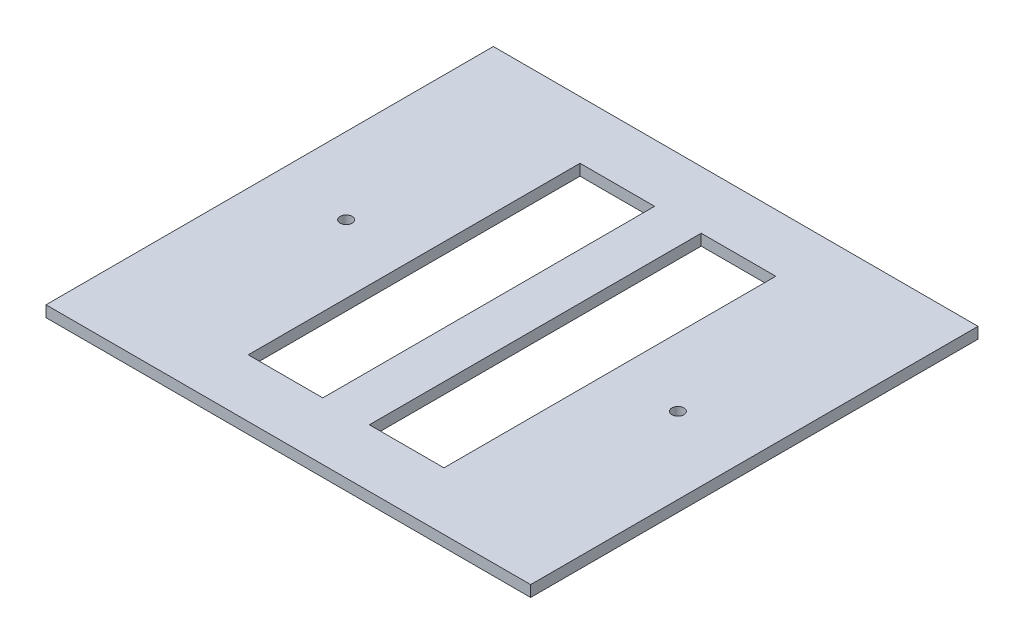
ISO-10303-21;
HEADER;
FILE_DESCRIPTION(('STEP AP214'),'2;1');
FILE_NAME('part.step','',(''),(''),'','','');
FILE_SCHEMA(('AUTOMOTIVE_DESIGN { 1 0 10303 214 1 1 1 1 }'));
ENDSEC;
DATA;
#1=APPLICATION_CONTEXT('core data for automotive mechanical design processes');
#2=APPLICATION_PROTOCOL_DEFINITION('international standard','automotive_design',2000,#1);
#3=PRODUCT_CONTEXT('',#1,'mechanical');
#4=PRODUCT('Part','Part','',(#3));
#5=PRODUCT_RELATED_PRODUCT_CATEGORY('part','',(#4));
#6=PRODUCT_DEFINITION_FORMATION('','',#4);
#7=PRODUCT_DEFINITION_CONTEXT('part definition',#1,'design');
#8=PRODUCT_DEFINITION('design','',#6,#7);
#9=PRODUCT_DEFINITION_SHAPE('','',#8);
#10=(LENGTH_UNIT() NAMED_UNIT(*) SI_UNIT(.MILLI.,.METRE.));
#11=(NAMED_UNIT(*) PLANE_ANGLE_UNIT() SI_UNIT($,.RADIAN.));
#12=(NAMED_UNIT(*) SI_UNIT($,.STERADIAN.) SOLID_ANGLE_UNIT());
#13=UNCERTAINTY_MEASURE_WITH_UNIT(LENGTH_MEASURE(1.E-05),#10,'distance_accuracy_value','');
#14=(GEOMETRIC_REPRESENTATION_CONTEXT(3) GLOBAL_UNCERTAINTY_ASSIGNED_CONTEXT((#13)) GLOBAL_UNIT_ASSIGNED_CONTEXT((#10,
#11,#12)) REPRESENTATION_CONTEXT('',''));
#15=CARTESIAN_POINT('',(0.,0.,0.));
#16=DIRECTION('',(0.,0.,1.));
#17=DIRECTION('',(1.,0.,0.));
#18=AXIS2_PLACEMENT_3D('',#15,#16,#17);
#19=CARTESIAN_POINT('',(0.,3.,0.));
#20=DIRECTION('',(0.,-1.,0.));
#21=DIRECTION('',(0.,0.,-1.));
#22=AXIS2_PLACEMENT_3D('',#19,#20,#21);
#23=PLANE('',#22);
#24=CARTESIAN_POINT('',(-44.5,3.,0.));
#25=DIRECTION('',(0.,-1.,0.));
#26=DIRECTION('',(0.,0.,-1.));
#27=AXIS2_PLACEMENT_3D('',#24,#25,#26);
#28=CIRCLE('',#27,1.6);
#29=CARTESIAN_POINT('',(-44.5,3.,-1.6));
#30=VERTEX_POINT('',#29);
#31=EDGE_CURVE('E313',#30,#30,#28,.F.);
#32=ORIENTED_EDGE('',*,*,#31,.F.);
#33=EDGE_LOOP('',(#32));
#34=FACE_BOUND('',#33,.T.);
#35=CARTESIAN_POINT('',(44.5,3.,0.));
#36=DIRECTION('',(0.,-1.,0.));
#37=DIRECTION('',(0.,0.,-1.));
#38=AXIS2_PLACEMENT_3D('',#35,#36,#37);
#39=CIRCLE('',#38,1.6);
#40=CARTESIAN_POINT('',(44.5,3.,-1.6));
#41=VERTEX_POINT('',#40);
#42=EDGE_CURVE('E138',#41,#41,#39,.T.);
#43=ORIENTED_EDGE('',*,*,#42,.T.);
#44=EDGE_LOOP('',(#43));
#45=FACE_BOUND('',#44,.T.);
#46=DIRECTION('',(0.,0.,-1.));
#47=VECTOR('',#46,1.);
#48=CARTESIAN_POINT('',(65.,3.,60.));
#49=LINE('',#48,#47);
#50=CARTESIAN_POINT('',(65.,3.,60.));
#51=VERTEX_POINT('',#50);
#52=CARTESIAN_POINT('',(65.,3.,-60.));
#53=VERTEX_POINT('',#52);
#54=EDGE_CURVE('E196',#51,#53,#49,.T.);
#55=ORIENTED_EDGE('',*,*,#54,.T.);
#56=DIRECTION('',(-1.,0.,0.));
#57=VECTOR('',#56,1.);
#58=CARTESIAN_POINT('',(-65.,3.,-60.));
#59=LINE('',#58,#57);
#60=CARTESIAN_POINT('',(-65.,3.,-60.));
#61=VERTEX_POINT('',#60);
#62=EDGE_CURVE('E199',#53,#61,#59,.T.);
#63=ORIENTED_EDGE('',*,*,#62,.T.);
#64=DIRECTION('',(0.,0.,1.));
#65=VECTOR('',#64,1.);
#66=CARTESIAN_POINT('',(-65.,3.,60.));
#67=LINE('',#66,#65);
#68=CARTESIAN_POINT('',(-65.,3.,60.));
#69=VERTEX_POINT('',#68);
#70=EDGE_CURVE('E202',#61,#69,#67,.T.);
#71=ORIENTED_EDGE('',*,*,#70,.T.);
#72=DIRECTION('',(1.,0.,0.));
#73=VECTOR('',#72,1.);
#74=CARTESIAN_POINT('',(-65.,3.,60.));
#75=LINE('',#74,#73);
#76=EDGE_CURVE('E204',#69,#51,#75,.T.);
#77=ORIENTED_EDGE('',*,*,#76,.T.);
#78=EDGE_LOOP('',(#55,#63,#71,#77));
#79=FACE_BOUND('',#78,.T.);
#80=DIRECTION('',(1.,0.,0.));
#81=VECTOR('',#80,1.);
#82=CARTESIAN_POINT('',(0.,3.,-44.5));
#83=LINE('',#82,#81);
#84=CARTESIAN_POINT('',(-26.25,3.,-44.5));
#85=VERTEX_POINT('',#84);
#86=CARTESIAN_POINT('',(-6.25,3.,-44.5));
#87=VERTEX_POINT('',#86);
#88=EDGE_CURVE('E176',#85,#87,#83,.T.);
#89=ORIENTED_EDGE('',*,*,#88,.T.);
#90=DIRECTION('',(0.,0.,1.));
#91=VECTOR('',#90,1.);
#92=CARTESIAN_POINT('',(-6.25,3.,0.));
#93=LINE('',#92,#91);
#94=CARTESIAN_POINT('',(-6.25,3.,44.5));
#95=VERTEX_POINT('',#94);
#96=EDGE_CURVE('E192',#87,#95,#93,.T.);
#97=ORIENTED_EDGE('',*,*,#96,.T.);
#98=DIRECTION('',(-1.,0.,0.));
#99=VECTOR('',#98,1.);
#100=CARTESIAN_POINT('',(0.,3.,44.5));
#101=LINE('',#100,#99);
#102=CARTESIAN_POINT('',(-26.25,3.,44.5));
#103=VERTEX_POINT('',#102);
#104=EDGE_CURVE('E189',#95,#103,#101,.T.);
#105=ORIENTED_EDGE('',*,*,#104,.T.);
#106=DIRECTION('',(0.,0.,-1.));
#107=VECTOR('',#106,1.);
#108=CARTESIAN_POINT('',(-26.25,3.,0.));
#109=LINE('',#108,#107);
#110=EDGE_CURVE('E186',#103,#85,#109,.T.);
#111=ORIENTED_EDGE('',*,*,#110,.T.);
#112=EDGE_LOOP('',(#89,#97,#105,#111));
#113=FACE_BOUND('',#112,.T.);
#114=DIRECTION('',(0.,0.,1.));
#115=VECTOR('',#114,1.);
#116=CARTESIAN_POINT('',(6.25,3.,0.));
#117=LINE('',#116,#115);
#118=CARTESIAN_POINT('',(6.25,3.,-44.5));
#119=VERTEX_POINT('',#118);
#120=CARTESIAN_POINT('',(6.25,3.,44.5));
#121=VERTEX_POINT('',#120);
#122=EDGE_CURVE('E132',#119,#121,#117,.T.);
#123=ORIENTED_EDGE('',*,*,#122,.F.);
#124=DIRECTION('',(-1.,0.,0.));
#125=VECTOR('',#124,1.);
#126=CARTESIAN_POINT('',(0.,3.,-44.5));
#127=LINE('',#126,#125);
#128=CARTESIAN_POINT('',(26.25,3.,-44.5));
#129=VERTEX_POINT('',#128);
#130=EDGE_CURVE('E157',#129,#119,#127,.T.);
#131=ORIENTED_EDGE('',*,*,#130,.F.);
#132=DIRECTION('',(0.,0.,-1.));
#133=VECTOR('',#132,1.);
#134=CARTESIAN_POINT('',(26.25,3.,0.));
#135=LINE('',#134,#133);
#136=CARTESIAN_POINT('',(26.25,3.,44.5));
#137=VERTEX_POINT('',#136);
#138=EDGE_CURVE('E155',#137,#129,#135,.T.);
#139=ORIENTED_EDGE('',*,*,#138,.F.);
#140=DIRECTION('',(1.,0.,0.));
#141=VECTOR('',#140,1.);
#142=CARTESIAN_POINT('',(0.,3.,44.5));
#143=LINE('',#142,#141);
#144=EDGE_CURVE('E149',#121,#137,#143,.T.);
#145=ORIENTED_EDGE('',*,*,#144,.F.);
#146=EDGE_LOOP('',(#123,#131,#139,#145));
#147=FACE_BOUND('',#146,.T.);
#148=ADVANCED_FACE('F33',(#34,#45,#79,#113,#147),#23,.F.);
#149=CARTESIAN_POINT('',(0.,0.,0.));
#150=DIRECTION('',(0.,-1.,0.));
#151=DIRECTION('',(0.,0.,-1.));
#152=AXIS2_PLACEMENT_3D('',#149,#150,#151);
#153=PLANE('',#152);
#154=CARTESIAN_POINT('',(-44.5,0.,0.));
#155=DIRECTION('',(0.,-1.,0.));
#156=DIRECTION('',(0.,0.,1.));
#157=AXIS2_PLACEMENT_3D('',#154,#155,#156);
#158=CIRCLE('',#157,1.6);
#159=CARTESIAN_POINT('',(-44.5,0.,1.6));
#160=VERTEX_POINT('',#159);
#161=EDGE_CURVE('E311',#160,#160,#158,.T.);
#162=ORIENTED_EDGE('',*,*,#161,.F.);
#163=EDGE_LOOP('',(#162));
#164=FACE_BOUND('',#163,.T.);
#165=CARTESIAN_POINT('',(44.5,0.,0.));
#166=DIRECTION('',(0.,1.,0.));
#167=DIRECTION('',(0.,0.,1.));
#168=AXIS2_PLACEMENT_3D('',#165,#166,#167);
#169=CIRCLE('',#168,1.6);
#170=CARTESIAN_POINT('',(44.5,0.,1.6));
#171=VERTEX_POINT('',#170);
#172=EDGE_CURVE('E141',#171,#171,#169,.T.);
#173=ORIENTED_EDGE('',*,*,#172,.T.);
#174=EDGE_LOOP('',(#173));
#175=FACE_BOUND('',#174,.T.);
#176=DIRECTION('',(0.,0.,-1.));
#177=VECTOR('',#176,1.);
#178=CARTESIAN_POINT('',(-6.25,0.,44.5));
#179=LINE('',#178,#177);
#180=CARTESIAN_POINT('',(-6.25,0.,44.5));
#181=VERTEX_POINT('',#180);
#182=CARTESIAN_POINT('',(-6.25,0.,-44.5));
#183=VERTEX_POINT('',#182);
#184=EDGE_CURVE('E160',#181,#183,#179,.T.);
#185=ORIENTED_EDGE('',*,*,#184,.T.);
#186=DIRECTION('',(-1.,0.,0.));
#187=VECTOR('',#186,1.);
#188=CARTESIAN_POINT('',(-26.25,0.,-44.5));
#189=LINE('',#188,#187);
#190=CARTESIAN_POINT('',(-26.25,0.,-44.5));
#191=VERTEX_POINT('',#190);
#192=EDGE_CURVE('E163',#183,#191,#189,.T.);
#193=ORIENTED_EDGE('',*,*,#192,.T.);
#194=DIRECTION('',(0.,0.,1.));
#195=VECTOR('',#194,1.);
#196=CARTESIAN_POINT('',(-26.25,0.,44.5));
#197=LINE('',#196,#195);
#198=CARTESIAN_POINT('',(-26.25,0.,44.5));
#199=VERTEX_POINT('',#198);
#200=EDGE_CURVE('E166',#191,#199,#197,.T.);
#201=ORIENTED_EDGE('',*,*,#200,.T.);
#202=DIRECTION('',(1.,0.,0.));
#203=VECTOR('',#202,1.);
#204=CARTESIAN_POINT('',(-26.25,0.,44.5));
#205=LINE('',#204,#203);
#206=EDGE_CURVE('E169',#199,#181,#205,.T.);
#207=ORIENTED_EDGE('',*,*,#206,.T.);
#208=EDGE_LOOP('',(#185,#193,#201,#207));
#209=FACE_BOUND('',#208,.T.);
#210=DIRECTION('',(0.,0.,-1.));
#211=VECTOR('',#210,1.);
#212=CARTESIAN_POINT('',(65.,0.,60.));
#213=LINE('',#212,#211);
#214=CARTESIAN_POINT('',(65.,0.,60.));
#215=VERTEX_POINT('',#214);
#216=CARTESIAN_POINT('',(65.,0.,-60.));
#217=VERTEX_POINT('',#216);
#218=EDGE_CURVE('E195',#215,#217,#213,.T.);
#219=ORIENTED_EDGE('',*,*,#218,.F.);
#220=DIRECTION('',(1.,0.,0.));
#221=VECTOR('',#220,1.);
#222=CARTESIAN_POINT('',(-65.,0.,60.));
#223=LINE('',#222,#221);
#224=CARTESIAN_POINT('',(-65.,0.,60.));
#225=VERTEX_POINT('',#224);
#226=EDGE_CURVE('E200',#225,#215,#223,.T.);
#227=ORIENTED_EDGE('',*,*,#226,.F.);
#228=DIRECTION('',(0.,0.,1.));
#229=VECTOR('',#228,1.);
#230=CARTESIAN_POINT('',(-65.,0.,60.));
#231=LINE('',#230,#229);
#232=CARTESIAN_POINT('',(-65.,0.,-60.));
#233=VERTEX_POINT('',#232);
#234=EDGE_CURVE('E211',#233,#225,#231,.T.);
#235=ORIENTED_EDGE('',*,*,#234,.F.);
#236=DIRECTION('',(-1.,0.,0.));
#237=VECTOR('',#236,1.);
#238=CARTESIAN_POINT('',(-65.,0.,-60.));
#239=LINE('',#238,#237);
#240=EDGE_CURVE('E209',#217,#233,#239,.T.);
#241=ORIENTED_EDGE('',*,*,#240,.F.);
#242=EDGE_LOOP('',(#219,#227,#235,#241));
#243=FACE_BOUND('',#242,.T.);
#244=DIRECTION('',(1.,0.,0.));
#245=VECTOR('',#244,1.);
#246=CARTESIAN_POINT('',(26.25,0.,-44.5));
#247=LINE('',#246,#245);
#248=CARTESIAN_POINT('',(6.25,0.,-44.5));
#249=VERTEX_POINT('',#248);
#250=CARTESIAN_POINT('',(26.25,0.,-44.5));
#251=VERTEX_POINT('',#250);
#252=EDGE_CURVE('E134',#249,#251,#247,.T.);
#253=ORIENTED_EDGE('',*,*,#252,.F.);
#254=DIRECTION('',(0.,0.,-1.));
#255=VECTOR('',#254,1.);
#256=CARTESIAN_POINT('',(6.25,0.,44.5));
#257=LINE('',#256,#255);
#258=CARTESIAN_POINT('',(6.25,0.,44.5));
#259=VERTEX_POINT('',#258);
#260=EDGE_CURVE('E125',#259,#249,#257,.T.);
#261=ORIENTED_EDGE('',*,*,#260,.F.);
#262=DIRECTION('',(-1.,0.,0.));
#263=VECTOR('',#262,1.);
#264=CARTESIAN_POINT('',(26.25,0.,44.5));
#265=LINE('',#264,#263);
#266=CARTESIAN_POINT('',(26.25,0.,44.5));
#267=VERTEX_POINT('',#266);
#268=EDGE_CURVE('E119',#267,#259,#265,.T.);
#269=ORIENTED_EDGE('',*,*,#268,.F.);
#270=DIRECTION('',(0.,0.,1.));
#271=VECTOR('',#270,1.);
#272=CARTESIAN_POINT('',(26.25,0.,44.5));
#273=LINE('',#272,#271);
#274=EDGE_CURVE('E124',#251,#267,#273,.T.);
#275=ORIENTED_EDGE('',*,*,#274,.F.);
#276=EDGE_LOOP('',(#253,#261,#269,#275));
#277=FACE_BOUND('',#276,.T.);
#278=ADVANCED_FACE('F137',(#164,#175,#209,#243,#277),#153,.T.);
#279=CARTESIAN_POINT('',(65.,3.,60.));
#280=DIRECTION('',(-1.,0.,0.));
#281=DIRECTION('',(0.,0.,1.));
#282=AXIS2_PLACEMENT_3D('',#279,#280,#281);
#283=PLANE('',#282);
#284=ORIENTED_EDGE('',*,*,#218,.T.);
#285=DIRECTION('',(0.,-1.,0.));
#286=VECTOR('',#285,1.);
#287=CARTESIAN_POINT('',(65.,3.,-60.));
#288=LINE('',#287,#286);
#289=EDGE_CURVE('E11',#53,#217,#288,.T.);
#290=ORIENTED_EDGE('',*,*,#289,.F.);
#291=ORIENTED_EDGE('',*,*,#54,.F.);
#292=DIRECTION('',(0.,-1.,0.));
#293=VECTOR('',#292,1.);
#294=CARTESIAN_POINT('',(65.,3.,60.));
#295=LINE('',#294,#293);
#296=EDGE_CURVE('E206',#51,#215,#295,.T.);
#297=ORIENTED_EDGE('',*,*,#296,.T.);
#298=EDGE_LOOP('',(#284,#290,#291,#297));
#299=FACE_BOUND('',#298,.T.);
#300=ADVANCED_FACE('F35',(#299),#283,.F.);
#301=CARTESIAN_POINT('',(-65.,3.,-60.));
#302=DIRECTION('',(0.,0.,1.));
#303=DIRECTION('',(1.,0.,0.));
#304=AXIS2_PLACEMENT_3D('',#301,#302,#303);
#305=PLANE('',#304);
#306=ORIENTED_EDGE('',*,*,#240,.T.);
#307=DIRECTION('',(0.,-1.,0.));
#308=VECTOR('',#307,1.);
#309=CARTESIAN_POINT('',(-65.,3.,-60.));
#310=LINE('',#309,#308);
#311=EDGE_CURVE('E41',#61,#233,#310,.T.);
#312=ORIENTED_EDGE('',*,*,#311,.F.);
#313=ORIENTED_EDGE('',*,*,#62,.F.);
#314=ORIENTED_EDGE('',*,*,#289,.T.);
#315=EDGE_LOOP('',(#306,#312,#313,#314));
#316=FACE_BOUND('',#315,.T.);
#317=ADVANCED_FACE('F238',(#316),#305,.F.);
#318=CARTESIAN_POINT('',(-65.,3.,60.));
#319=DIRECTION('',(1.,0.,0.));
#320=DIRECTION('',(0.,0.,-1.));
#321=AXIS2_PLACEMENT_3D('',#318,#319,#320);
#322=PLANE('',#321);
#323=ORIENTED_EDGE('',*,*,#234,.T.);
#324=DIRECTION('',(0.,-1.,0.));
#325=VECTOR('',#324,1.);
#326=CARTESIAN_POINT('',(-65.,3.,60.));
#327=LINE('',#326,#325);
#328=EDGE_CURVE('E216',#69,#225,#327,.T.);
#329=ORIENTED_EDGE('',*,*,#328,.F.);
#330=ORIENTED_EDGE('',*,*,#70,.F.);
#331=ORIENTED_EDGE('',*,*,#311,.T.);
#332=EDGE_LOOP('',(#323,#329,#330,#331));
#333=FACE_BOUND('',#332,.T.);
#334=ADVANCED_FACE('F223',(#333),#322,.F.);
#335=CARTESIAN_POINT('',(-65.,3.,60.));
#336=DIRECTION('',(0.,0.,-1.));
#337=DIRECTION('',(-1.,0.,0.));
#338=AXIS2_PLACEMENT_3D('',#335,#336,#337);
#339=PLANE('',#338);
#340=ORIENTED_EDGE('',*,*,#226,.T.);
#341=ORIENTED_EDGE('',*,*,#296,.F.);
#342=ORIENTED_EDGE('',*,*,#76,.F.);
#343=ORIENTED_EDGE('',*,*,#328,.T.);
#344=EDGE_LOOP('',(#340,#341,#342,#343));
#345=FACE_BOUND('',#344,.T.);
#346=ADVANCED_FACE('F231',(#345),#339,.F.);
#347=CARTESIAN_POINT('',(-6.25,0.,44.5));
#348=DIRECTION('',(1.,0.,0.));
#349=DIRECTION('',(0.,0.,-1.));
#350=AXIS2_PLACEMENT_3D('',#347,#348,#349);
#351=PLANE('',#350);
#352=DIRECTION('',(0.,1.,0.));
#353=VECTOR('',#352,1.);
#354=CARTESIAN_POINT('',(-6.25,0.,-44.5));
#355=LINE('',#354,#353);
#356=EDGE_CURVE('E172',#183,#87,#355,.T.);
#357=ORIENTED_EDGE('',*,*,#356,.F.);
#358=ORIENTED_EDGE('',*,*,#184,.F.);
#359=DIRECTION('',(0.,1.,0.));
#360=VECTOR('',#359,1.);
#361=CARTESIAN_POINT('',(-6.25,0.,44.5));
#362=LINE('',#361,#360);
#363=EDGE_CURVE('E173',#181,#95,#362,.T.);
#364=ORIENTED_EDGE('',*,*,#363,.T.);
#365=ORIENTED_EDGE('',*,*,#96,.F.);
#366=EDGE_LOOP('',(#357,#358,#364,#365));
#367=FACE_BOUND('',#366,.T.);
#368=ADVANCED_FACE('F256',(#367),#351,.F.);
#369=CARTESIAN_POINT('',(-26.25,0.,44.5));
#370=DIRECTION('',(0.,0.,1.));
#371=DIRECTION('',(1.,0.,0.));
#372=AXIS2_PLACEMENT_3D('',#369,#370,#371);
#373=PLANE('',#372);
#374=ORIENTED_EDGE('',*,*,#363,.F.);
#375=ORIENTED_EDGE('',*,*,#206,.F.);
#376=DIRECTION('',(0.,1.,0.));
#377=VECTOR('',#376,1.);
#378=CARTESIAN_POINT('',(-26.25,0.,44.5));
#379=LINE('',#378,#377);
#380=EDGE_CURVE('E177',#199,#103,#379,.T.);
#381=ORIENTED_EDGE('',*,*,#380,.T.);
#382=ORIENTED_EDGE('',*,*,#104,.F.);
#383=EDGE_LOOP('',(#374,#375,#381,#382));
#384=FACE_BOUND('',#383,.T.);
#385=ADVANCED_FACE('F263',(#384),#373,.F.);
#386=CARTESIAN_POINT('',(-26.25,0.,44.5));
#387=DIRECTION('',(-1.,0.,0.));
#388=DIRECTION('',(0.,0.,1.));
#389=AXIS2_PLACEMENT_3D('',#386,#387,#388);
#390=PLANE('',#389);
#391=ORIENTED_EDGE('',*,*,#380,.F.);
#392=ORIENTED_EDGE('',*,*,#200,.F.);
#393=DIRECTION('',(0.,1.,0.));
#394=VECTOR('',#393,1.);
#395=CARTESIAN_POINT('',(-26.25,0.,-44.5));
#396=LINE('',#395,#394);
#397=EDGE_CURVE('E180',#191,#85,#396,.T.);
#398=ORIENTED_EDGE('',*,*,#397,.T.);
#399=ORIENTED_EDGE('',*,*,#110,.F.);
#400=EDGE_LOOP('',(#391,#392,#398,#399));
#401=FACE_BOUND('',#400,.T.);
#402=ADVANCED_FACE('F268',(#401),#390,.F.);
#403=CARTESIAN_POINT('',(-26.25,0.,-44.5));
#404=DIRECTION('',(0.,0.,-1.));
#405=DIRECTION('',(-1.,0.,0.));
#406=AXIS2_PLACEMENT_3D('',#403,#404,#405);
#407=PLANE('',#406);
#408=ORIENTED_EDGE('',*,*,#397,.F.);
#409=ORIENTED_EDGE('',*,*,#192,.F.);
#410=ORIENTED_EDGE('',*,*,#356,.T.);
#411=ORIENTED_EDGE('',*,*,#88,.F.);
#412=EDGE_LOOP('',(#408,#409,#410,#411));
#413=FACE_BOUND('',#412,.T.);
#414=ADVANCED_FACE('F276',(#413),#407,.F.);
#415=CARTESIAN_POINT('',(6.25,0.,44.5));
#416=DIRECTION('',(1.,0.,0.));
#417=DIRECTION('',(0.,0.,-1.));
#418=AXIS2_PLACEMENT_3D('',#415,#416,#417);
#419=PLANE('',#418);
#420=ORIENTED_EDGE('',*,*,#122,.T.);
#421=DIRECTION('',(0.,1.,0.));
#422=VECTOR('',#421,1.);
#423=CARTESIAN_POINT('',(6.25,0.,44.5));
#424=LINE('',#423,#422);
#425=EDGE_CURVE('E48',#259,#121,#424,.T.);
#426=ORIENTED_EDGE('',*,*,#425,.F.);
#427=ORIENTED_EDGE('',*,*,#260,.T.);
#428=DIRECTION('',(0.,1.,0.));
#429=VECTOR('',#428,1.);
#430=CARTESIAN_POINT('',(6.25,0.,-44.5));
#431=LINE('',#430,#429);
#432=EDGE_CURVE('E147',#249,#119,#431,.T.);
#433=ORIENTED_EDGE('',*,*,#432,.T.);
#434=EDGE_LOOP('',(#420,#426,#427,#433));
#435=FACE_BOUND('',#434,.T.);
#436=ADVANCED_FACE('F128',(#435),#419,.T.);
#437=CARTESIAN_POINT('',(26.25,0.,-44.5));
#438=DIRECTION('',(0.,0.,1.));
#439=DIRECTION('',(1.,0.,0.));
#440=AXIS2_PLACEMENT_3D('',#437,#438,#439);
#441=PLANE('',#440);
#442=ORIENTED_EDGE('',*,*,#130,.T.);
#443=ORIENTED_EDGE('',*,*,#432,.F.);
#444=ORIENTED_EDGE('',*,*,#252,.T.);
#445=DIRECTION('',(0.,1.,0.));
#446=VECTOR('',#445,1.);
#447=CARTESIAN_POINT('',(26.25,0.,-44.5));
#448=LINE('',#447,#446);
#449=EDGE_CURVE('E150',#251,#129,#448,.T.);
#450=ORIENTED_EDGE('',*,*,#449,.T.);
#451=EDGE_LOOP('',(#442,#443,#444,#450));
#452=FACE_BOUND('',#451,.T.);
#453=ADVANCED_FACE('F289',(#452),#441,.T.);
#454=CARTESIAN_POINT('',(26.25,0.,44.5));
#455=DIRECTION('',(-1.,0.,0.));
#456=DIRECTION('',(0.,0.,1.));
#457=AXIS2_PLACEMENT_3D('',#454,#455,#456);
#458=PLANE('',#457);
#459=ORIENTED_EDGE('',*,*,#138,.T.);
#460=ORIENTED_EDGE('',*,*,#449,.F.);
#461=ORIENTED_EDGE('',*,*,#274,.T.);
#462=DIRECTION('',(0.,1.,0.));
#463=VECTOR('',#462,1.);
#464=CARTESIAN_POINT('',(26.25,0.,44.5));
#465=LINE('',#464,#463);
#466=EDGE_CURVE('E53',#267,#137,#465,.T.);
#467=ORIENTED_EDGE('',*,*,#466,.T.);
#468=EDGE_LOOP('',(#459,#460,#461,#467));
#469=FACE_BOUND('',#468,.T.);
#470=ADVANCED_FACE('F293',(#469),#458,.T.);
#471=CARTESIAN_POINT('',(26.25,0.,44.5));
#472=DIRECTION('',(0.,0.,-1.));
#473=DIRECTION('',(-1.,0.,0.));
#474=AXIS2_PLACEMENT_3D('',#471,#472,#473);
#475=PLANE('',#474);
#476=ORIENTED_EDGE('',*,*,#144,.T.);
#477=ORIENTED_EDGE('',*,*,#466,.F.);
#478=ORIENTED_EDGE('',*,*,#268,.T.);
#479=ORIENTED_EDGE('',*,*,#425,.T.);
#480=EDGE_LOOP('',(#476,#477,#478,#479));
#481=FACE_BOUND('',#480,.T.);
#482=ADVANCED_FACE('F120',(#481),#475,.T.);
#483=CARTESIAN_POINT('',(44.5,0.,0.));
#484=DIRECTION('',(0.,1.,0.));
#485=DIRECTION('',(0.,0.,1.));
#486=AXIS2_PLACEMENT_3D('',#483,#484,#485);
#487=CYLINDRICAL_SURFACE('',#486,1.6);
#488=ORIENTED_EDGE('',*,*,#172,.F.);
#489=EDGE_LOOP('',(#488));
#490=FACE_BOUND('',#489,.T.);
#491=ORIENTED_EDGE('',*,*,#42,.F.);
#492=EDGE_LOOP('',(#491));
#493=FACE_BOUND('',#492,.T.);
#494=ADVANCED_FACE('F292',(#490,#493),#487,.F.);
#495=CARTESIAN_POINT('',(-44.5,0.,0.));
#496=DIRECTION('',(0.,1.,0.));
#497=DIRECTION('',(0.,0.,1.));
#498=AXIS2_PLACEMENT_3D('',#495,#496,#497);
#499=CYLINDRICAL_SURFACE('',#498,1.6);
#500=ORIENTED_EDGE('',*,*,#161,.T.);
#501=EDGE_LOOP('',(#500));
#502=FACE_BOUND('',#501,.T.);
#503=ORIENTED_EDGE('',*,*,#31,.T.);
#504=EDGE_LOOP('',(#503));
#505=FACE_BOUND('',#504,.T.);
#506=ADVANCED_FACE('F302',(#502,#505),#499,.F.);
#507=CLOSED_SHELL('',(#148,#278,#300,#317,#334,#346,#368,#385,#402,#414,#436,#453,#470,#482,
#494,#506));
#508=MANIFOLD_SOLID_BREP('B2',#507);
#509=ADVANCED_BREP_SHAPE_REPRESENTATION('',(#18,#508),#14);
#510=SHAPE_DEFINITION_REPRESENTATION(#9,#509);
ENDSEC;
END-ISO-10303-21;
